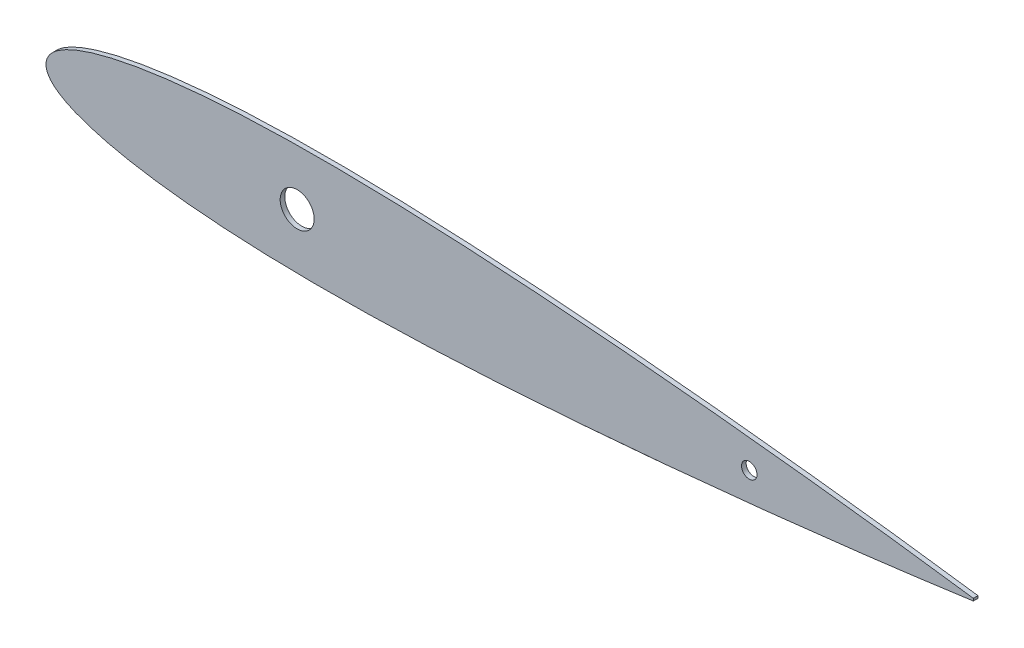
ISO-10303-21;
HEADER;
FILE_DESCRIPTION(('STEP AP214'),'2;1');
FILE_NAME('part.step','',(''),(''),'','','');
FILE_SCHEMA(('AUTOMOTIVE_DESIGN { 1 0 10303 214 1 1 1 1 }'));
ENDSEC;
DATA;
#1=APPLICATION_CONTEXT('core data for automotive mechanical design processes');
#2=APPLICATION_PROTOCOL_DEFINITION('international standard','automotive_design',2000,#1);
#3=PRODUCT_CONTEXT('',#1,'mechanical');
#4=PRODUCT('Part','Part','',(#3));
#5=PRODUCT_RELATED_PRODUCT_CATEGORY('part','',(#4));
#6=PRODUCT_DEFINITION_FORMATION('','',#4);
#7=PRODUCT_DEFINITION_CONTEXT('part definition',#1,'design');
#8=PRODUCT_DEFINITION('design','',#6,#7);
#9=PRODUCT_DEFINITION_SHAPE('','',#8);
#10=(LENGTH_UNIT() NAMED_UNIT(*) SI_UNIT(.MILLI.,.METRE.));
#11=(NAMED_UNIT(*) PLANE_ANGLE_UNIT() SI_UNIT($,.RADIAN.));
#12=(NAMED_UNIT(*) SI_UNIT($,.STERADIAN.) SOLID_ANGLE_UNIT());
#13=UNCERTAINTY_MEASURE_WITH_UNIT(LENGTH_MEASURE(1.E-05),#10,'distance_accuracy_value','');
#14=(GEOMETRIC_REPRESENTATION_CONTEXT(3) GLOBAL_UNCERTAINTY_ASSIGNED_CONTEXT((#13)) GLOBAL_UNIT_ASSIGNED_CONTEXT((#10,
#11,#12)) REPRESENTATION_CONTEXT('',''));
#15=CARTESIAN_POINT('',(0.,0.,0.));
#16=DIRECTION('',(0.,0.,1.));
#17=DIRECTION('',(1.,0.,0.));
#18=AXIS2_PLACEMENT_3D('',#15,#16,#17);
#19=CARTESIAN_POINT('',(300.,0.378000085790989,1.5));
#20=CARTESIAN_POINT('',(299.270406258191,0.47944593050947,1.5));
#21=CARTESIAN_POINT('',(297.234666466675,0.762503926957386,1.5));
#22=CARTESIAN_POINT('',(293.659648722086,1.25767379104816,1.5));
#23=CARTESIAN_POINT('',(289.112409324718,1.87424286789368,1.5));
#24=CARTESIAN_POINT('',(284.080813047262,2.54451801768884,1.5));
#25=CARTESIAN_POINT('',(278.752039397675,3.23812305057695,1.5));
#26=CARTESIAN_POINT('',(273.265892957003,3.93494732849179,1.5));
#27=CARTESIAN_POINT('',(267.705948145067,4.62902099310258,1.5));
#28=CARTESIAN_POINT('',(262.11455442435,5.31307031240466,1.5));
#29=CARTESIAN_POINT('',(256.508339041981,5.98219316973427,1.5));
#30=CARTESIAN_POINT('',(250.891727852538,6.63799231512792,1.5));
#31=CARTESIAN_POINT('',(245.269544547784,7.28178088713761,1.5));
#32=CARTESIAN_POINT('',(239.647331655705,7.91223455869152,1.5));
#33=CARTESIAN_POINT('',(234.025115138361,8.52699398080148,1.5));
#34=CARTESIAN_POINT('',(228.399071657966,9.1262318344847,1.5));
#35=CARTESIAN_POINT('',(222.768240122571,9.71307980985098,1.5));
#36=CARTESIAN_POINT('',(217.135901992854,10.2874621437674,1.5));
#37=CARTESIAN_POINT('',(211.505390076213,10.8469435449548,1.5));
#38=CARTESIAN_POINT('',(205.877598448554,11.3916454113051,1.5));
#39=CARTESIAN_POINT('',(200.251489742703,11.9208873285711,1.5));
#40=CARTESIAN_POINT('',(194.626396629031,12.4346198992476,1.5));
#41=CARTESIAN_POINT('',(189.002771953878,12.9319147435062,1.5));
#42=CARTESIAN_POINT('',(183.38150447918,13.4131006245791,1.5));
#43=CARTESIAN_POINT('',(177.763197882755,13.8763798492961,1.5));
#44=CARTESIAN_POINT('',(172.14827252579,14.3212404427836,1.5));
#45=CARTESIAN_POINT('',(166.537499181283,14.7478242644361,1.5));
#46=CARTESIAN_POINT('',(160.931704641983,15.1542315822589,1.5));
#47=CARTESIAN_POINT('',(155.33167602762,15.5391043814315,1.5));
#48=CARTESIAN_POINT('',(149.737504253089,15.9026531716997,1.5));
#49=CARTESIAN_POINT('',(144.148652919446,16.241849803566,1.5));
#50=CARTESIAN_POINT('',(138.565642977727,16.5574243030179,1.5));
#51=CARTESIAN_POINT('',(132.990821911634,16.8474013776404,1.5));
#52=CARTESIAN_POINT('',(127.427400286612,17.1102155605441,1.5));
#53=CARTESIAN_POINT('',(121.87757922466,17.3438956525447,1.5));
#54=CARTESIAN_POINT('',(116.340716908339,17.545260793534,1.5));
#55=CARTESIAN_POINT('',(110.815433459798,17.7126831386234,1.5));
#56=CARTESIAN_POINT('',(105.301229224759,17.844501986589,1.5));
#57=CARTESIAN_POINT('',(99.8005246938465,17.9400958831727,1.5));
#58=CARTESIAN_POINT('',(94.3173891780334,17.9965945216749,1.5));
#59=CARTESIAN_POINT('',(88.8557161622829,18.0101285441361,1.5));
#60=CARTESIAN_POINT('',(83.4185988364478,17.9792379195056,1.5));
#61=CARTESIAN_POINT('',(78.0084304611897,17.899164774015,1.5));
#62=CARTESIAN_POINT('',(72.6284037782424,17.7670378182798,1.5));
#63=CARTESIAN_POINT('',(67.2826859463778,17.5794179221706,1.5));
#64=CARTESIAN_POINT('',(61.9773108914634,17.3315194209052,1.5));
#65=CARTESIAN_POINT('',(56.720635819959,17.0210365128789,1.5));
#66=CARTESIAN_POINT('',(51.525118947017,16.640961845402,1.5));
#67=CARTESIAN_POINT('',(46.4081450832694,16.1901922640123,1.5));
#68=CARTESIAN_POINT('',(41.3941173921596,15.6616726526714,1.5));
#69=CARTESIAN_POINT('',(36.5156113066675,15.0539671994517,1.5));
#70=CARTESIAN_POINT('',(31.8189485954638,14.3656268642819,1.5));
#71=CARTESIAN_POINT('',(27.3661029727954,13.6034787702631,1.5));
#72=CARTESIAN_POINT('',(23.2351551610893,12.7825863440271,1.5));
#73=CARTESIAN_POINT('',(19.5025788109589,11.9202534557745,1.5));
#74=CARTESIAN_POINT('',(16.2182070077725,11.0446003021048,1.5));
#75=CARTESIAN_POINT('',(13.3891209887172,10.17507856394,1.5));
#76=CARTESIAN_POINT('',(10.9848637611105,9.3335008330135,1.5));
#77=CARTESIAN_POINT('',(8.96149544609948,8.52206481504195,1.5));
#78=CARTESIAN_POINT('',(7.26722563700957,7.74697775939544,1.5));
#79=CARTESIAN_POINT('',(5.84598572737683,7.01062721234571,1.5));
#80=CARTESIAN_POINT('',(4.64764407483782,6.30063546243401,1.5));
#81=CARTESIAN_POINT('',(3.62816800978614,5.60651493999264,1.5));
#82=CARTESIAN_POINT('',(2.75184175672911,4.92663636939092,1.5));
#83=CARTESIAN_POINT('',(2.0061897507256,4.24991822327024,1.5));
#84=CARTESIAN_POINT('',(1.3905183875593,3.57026030201869,1.5));
#85=CARTESIAN_POINT('',(0.900932574603405,2.89094290818637,1.5));
#86=CARTESIAN_POINT('',(0.529207590380777,2.22021977713324,1.5));
#87=CARTESIAN_POINT('',(0.260411531407435,1.56645929130347,1.5));
#88=CARTESIAN_POINT('',(0.0856446086737119,0.931036139354004,1.5));
#89=CARTESIAN_POINT('',(-0.00357731260795448,0.30898108461408,1.5));
#90=CARTESIAN_POINT('',(-0.00357731260776856,-0.308981084614831,1.5));
#91=CARTESIAN_POINT('',(0.0856446086737131,-0.931036139354699,1.5));
#92=CARTESIAN_POINT('',(0.260411531407615,-1.56645929130414,1.5));
#93=CARTESIAN_POINT('',(0.529207590381365,-2.22021977713392,1.5));
#94=CARTESIAN_POINT('',(0.900932574603896,-2.89094290818698,1.5));
#95=CARTESIAN_POINT('',(1.39051838756001,-3.57026030201881,1.5));
#96=CARTESIAN_POINT('',(2.00618975072613,-4.24991822327227,1.5));
#97=CARTESIAN_POINT('',(2.7518417567314,-4.92663636938398,1.5));
#98=CARTESIAN_POINT('',(3.62816800978217,-5.60651494002356,1.5));
#99=CARTESIAN_POINT('',(4.64764407486176,-6.3006354622981,1.5));
#100=CARTESIAN_POINT('',(5.84598572727588,-7.01062721295838,1.5));
#101=CARTESIAN_POINT('',(7.26722563748644,-7.74697775654586,1.5));
#102=CARTESIAN_POINT('',(8.96149544385093,-8.52206482852457,1.5));
#103=CARTESIAN_POINT('',(10.9848637718126,-9.33350076889671,1.5));
#104=CARTESIAN_POINT('',(13.3891209381216,-10.1750788671249,1.5));
#105=CARTESIAN_POINT('',(16.2182072447027,-11.0445988824028,1.5));
#106=CARTESIAN_POINT('',(19.5025777214158,-11.9202599844474,1.5));
#107=CARTESIAN_POINT('',(23.2351600059408,-12.7825573131507,1.5));
#108=CARTESIAN_POINT('',(27.366065702866,-13.6035992472578,1.5));
#109=CARTESIAN_POINT('',(31.8190141628901,-14.365116622676,1.5));
#110=CARTESIAN_POINT('',(36.5155748574454,-15.0541095127907,1.5));
#111=CARTESIAN_POINT('',(41.3941235310745,-15.6616324404357,1.5));
#112=CARTESIAN_POINT('',(46.4081433882141,-16.1902033672854,1.5));
#113=CARTESIAN_POINT('',(51.5251194115053,-16.6409588028352,1.5));
#114=CARTESIAN_POINT('',(56.7206356933644,-17.0210373421311,1.5));
#115=CARTESIAN_POINT('',(61.9773109258477,-17.3315191956824,1.5));
#116=CARTESIAN_POINT('',(67.2826859370659,-17.5794179831741,1.5));
#117=CARTESIAN_POINT('',(72.628403780765,-17.7670378017619,1.5));
#118=CARTESIAN_POINT('',(78.0084304605121,-17.8991647784591,1.5));
#119=CARTESIAN_POINT('',(83.4185988366349,-17.9792379182859,1.5));
#120=CARTESIAN_POINT('',(88.8557161622367,-18.0101285444441,1.5));
#121=CARTESIAN_POINT('',(94.3173891780499,-17.9965945215692,1.5));
#122=CARTESIAN_POINT('',(99.8005246938458,-17.9400958831771,1.5));
#123=CARTESIAN_POINT('',(105.301229224763,-17.8445019865625,1.5));
#124=CARTESIAN_POINT('',(110.8154334598,-17.7126831386037,1.5));
#125=CARTESIAN_POINT('',(116.340716908343,-17.5452607935111,1.5));
#126=CARTESIAN_POINT('',(121.877579224663,-17.3438956525212,1.5));
#127=CARTESIAN_POINT('',(127.427400286615,-17.1102155605194,1.5));
#128=CARTESIAN_POINT('',(132.990821911637,-16.8474013776146,1.5));
#129=CARTESIAN_POINT('',(138.565642977729,-16.557424302991,1.5));
#130=CARTESIAN_POINT('',(144.148652919448,-16.241849803538,1.5));
#131=CARTESIAN_POINT('',(149.737504253092,-15.9026531716705,1.5));
#132=CARTESIAN_POINT('',(155.331676027623,-15.5391043814012,1.5));
#133=CARTESIAN_POINT('',(160.931704641986,-15.1542315822275,1.5));
#134=CARTESIAN_POINT('',(166.537499181286,-14.7478242644037,1.5));
#135=CARTESIAN_POINT('',(172.148272525793,-14.32124044275,1.5));
#136=CARTESIAN_POINT('',(177.763197882757,-13.8763798492613,1.5));
#137=CARTESIAN_POINT('',(183.381504479182,-13.4131006245432,1.5));
#138=CARTESIAN_POINT('',(189.002771953881,-12.9319147434693,1.5));
#139=CARTESIAN_POINT('',(194.626396629033,-12.4346198992095,1.5));
#140=CARTESIAN_POINT('',(200.251489742704,-11.9208873285319,1.5));
#141=CARTESIAN_POINT('',(205.877598448556,-11.3916454112647,1.5));
#142=CARTESIAN_POINT('',(211.505390076214,-10.8469435449134,1.5));
#143=CARTESIAN_POINT('',(217.135901992857,-10.2874621437248,1.5));
#144=CARTESIAN_POINT('',(222.768240122573,-9.71307980980728,1.5));
#145=CARTESIAN_POINT('',(228.399071657967,-9.12623183443991,1.5));
#146=CARTESIAN_POINT('',(234.025115138362,-8.52699398075554,1.5));
#147=CARTESIAN_POINT('',(239.647331655707,-7.91223455864449,1.5));
#148=CARTESIAN_POINT('',(245.269544547784,-7.28178088708938,1.5));
#149=CARTESIAN_POINT('',(250.891727852538,-6.63799231507864,1.5));
#150=CARTESIAN_POINT('',(256.508339041982,-5.98219316968383,1.5));
#151=CARTESIAN_POINT('',(262.114554424352,-5.31307031235314,1.5));
#152=CARTESIAN_POINT('',(267.705948145068,-4.6290209930499,1.5));
#153=CARTESIAN_POINT('',(273.265892957004,-3.934947328438,1.5));
#154=CARTESIAN_POINT('',(278.752039397677,-3.23812305052208,1.5));
#155=CARTESIAN_POINT('',(284.080813047262,-2.54451801763288,1.5));
#156=CARTESIAN_POINT('',(289.112409324719,-1.87424286783675,1.5));
#157=CARTESIAN_POINT('',(293.659648722086,-1.25767379099031,1.5));
#158=CARTESIAN_POINT('',(297.234666466675,-0.762503926898819,1.5));
#159=CARTESIAN_POINT('',(299.270406258191,-0.479445930450507,1.5));
#160=CARTESIAN_POINT('',(300.,-0.378000085731868,1.5));
#161=B_SPLINE_CURVE_WITH_KNOTS('',3,(#19,#20,#21,#22,#23,#24,#25,#26,#27,#28,#29,#30,#31,#32,
#33,#34,#35,#36,#37,#38,#39,#40,#41,#42,#43,#44,#45,#46,#47,#48,#49,#50,#51,#52,#53,#54,#55,#56,
#57,#58,#59,#60,#61,#62,#63,#64,#65,#66,#67,#68,#69,#70,#71,#72,#73,#74,#75,#76,#77,#78,#79,#80,
#81,#82,#83,#84,#85,#86,#87,#88,#89,#90,#91,#92,#93,#94,#95,#96,#97,#98,#99,#100,#101,#102,#103,
#104,#105,#106,#107,#108,#109,#110,#111,#112,#113,#114,#115,#116,#117,#118,#119,#120,#121,#122,
#123,#124,#125,#126,#127,#128,#129,#130,#131,#132,#133,#134,#135,#136,#137,#138,#139,#140,#141,
#142,#143,#144,#145,#146,#147,#148,#149,#150,#151,#152,#153,#154,#155,#156,#157,#158,#159,#160),
.UNSPECIFIED.,.F.,.F.,(4,1,1,1,1,1,1,1,1,1,1,1,1,1,1,1,1,1,1,1,1,1,1,1,1,1,1,1,1,1,1,1,1,1,1,1,
1,1,1,1,1,1,1,1,1,1,1,1,1,1,1,1,1,1,1,1,1,1,1,1,1,1,1,1,1,1,1,1,1,1,1,1,1,1,1,1,1,1,1,1,1,1,1,1,
1,1,1,1,1,1,1,1,1,1,1,1,1,1,1,1,1,1,1,1,1,1,1,1,1,1,1,1,1,1,1,1,1,1,1,1,1,1,1,1,1,1,1,1,1,1,1,1,
1,1,1,1,1,1,1,4),(0.,0.00361222059404388,0.0100789532278554,0.0176986181570895,
0.0261151107220122,0.0349709660638799,0.0440503796486832,0.0532343297369713,0.0624475697827881,
0.0716739929600303,0.0809213185094618,0.0901775382979332,0.0994243421366575,0.108664440992277,
0.117912199004999,0.127169502180609,0.136426594565023,0.145675425736823,0.154916495397513,
0.164153236916375,0.173386648526191,0.182615736180586,0.191838089492061,0.201053134496137,
0.210260392550908,0.219458942389608,0.228646746886173,0.237822316287067,0.24698522413025,
0.25613738364592,0.265279415916296,0.274406949966901,0.283512193452554,0.292591781113348,
0.30164628535433,0.310681792653752,0.31969906757785,0.32869451957993,0.337660159695399,
0.346588583205171,0.355477411634764,0.364322937295264,0.373121613643215,0.381867635356829,
0.390553004884712,0.399166025869356,0.407689628257838,0.416098119030288,0.424354887451602,
0.432412428746428,0.440204728485537,0.447630505181733,0.454563637698397,0.460855379429517,
0.466413319364109,0.471228610451128,0.475365774282038,0.478901259753558,0.481915077255184,
0.484498871900912,0.486747127386087,0.488741251833575,0.490543179252672,0.492182103901344,
0.493672830547239,0.495031907807012,0.496279059618418,0.497424736506128,0.498490165528455,
0.499502757789975,0.500497253863142,0.501509846124661,0.502575275146988,0.503720952034698,
0.504968103846104,0.506327181105877,0.507817907751772,0.509456832400444,0.511258759819541,
0.51325288426703,0.515501139752205,0.518084934397933,0.521098751899559,0.524634237371078,
0.528771401201989,0.533586692289008,0.539144632223599,0.545436373954719,0.552369506471383,
0.559795200118754,0.567587571253572,0.575645112548398,0.583901880969712,0.592310371742162,
0.600833974130644,0.609446995115288,0.618132364643171,0.626878386356785,0.635677062704736,
0.644522588365236,0.653411416794829,0.662339840304601,0.67130548042007,0.68030093242215,
0.689318207346248,0.69835371464567,0.707408218886652,0.716487806547446,0.725593050033099,
0.734720584083704,0.74386261635408,0.75301477586975,0.762177683712933,0.771353253113827,
0.780541057610392,0.789739607449093,0.798946865503863,0.808161910507939,0.817384263819414,
0.826613351473809,0.835846763083625,0.845083504602487,0.854324574263177,0.863573405434977,
0.872830497819391,0.882087800995001,0.891335559007723,0.900575657863343,0.909822461702067,
0.919078681490538,0.92832600703997,0.937552430217212,0.946765670263029,0.955949620351317,
0.96502903393612,0.973884889277988,0.982301381842911,0.989921046772145,0.996387779405956,1.),.UNSPECIFIED.);
#162=DIRECTION('',(0.,0.,-1.));
#163=VECTOR('',#162,1.);
#164=SURFACE_OF_LINEAR_EXTRUSION('',#161,#163);
#165=CARTESIAN_POINT('',(300.,0.378000085790989,0.));
#166=CARTESIAN_POINT('',(299.270406258191,0.47944593050947,0.));
#167=CARTESIAN_POINT('',(297.234666466675,0.762503926957386,0.));
#168=CARTESIAN_POINT('',(293.659648722086,1.25767379104816,0.));
#169=CARTESIAN_POINT('',(289.112409324718,1.87424286789368,0.));
#170=CARTESIAN_POINT('',(284.080813047262,2.54451801768884,0.));
#171=CARTESIAN_POINT('',(278.752039397675,3.23812305057695,0.));
#172=CARTESIAN_POINT('',(273.265892957003,3.93494732849179,0.));
#173=CARTESIAN_POINT('',(267.705948145067,4.62902099310258,0.));
#174=CARTESIAN_POINT('',(262.11455442435,5.31307031240466,0.));
#175=CARTESIAN_POINT('',(256.508339041981,5.98219316973427,0.));
#176=CARTESIAN_POINT('',(250.891727852538,6.63799231512792,0.));
#177=CARTESIAN_POINT('',(245.269544547784,7.28178088713761,0.));
#178=CARTESIAN_POINT('',(239.647331655705,7.91223455869152,0.));
#179=CARTESIAN_POINT('',(234.025115138361,8.52699398080148,0.));
#180=CARTESIAN_POINT('',(228.399071657966,9.1262318344847,0.));
#181=CARTESIAN_POINT('',(222.768240122571,9.71307980985098,0.));
#182=CARTESIAN_POINT('',(217.135901992854,10.2874621437674,0.));
#183=CARTESIAN_POINT('',(211.505390076213,10.8469435449548,0.));
#184=CARTESIAN_POINT('',(205.877598448554,11.3916454113051,0.));
#185=CARTESIAN_POINT('',(200.251489742703,11.9208873285711,0.));
#186=CARTESIAN_POINT('',(194.626396629031,12.4346198992476,0.));
#187=CARTESIAN_POINT('',(189.002771953878,12.9319147435062,0.));
#188=CARTESIAN_POINT('',(183.38150447918,13.4131006245791,0.));
#189=CARTESIAN_POINT('',(177.763197882755,13.8763798492961,0.));
#190=CARTESIAN_POINT('',(172.14827252579,14.3212404427836,0.));
#191=CARTESIAN_POINT('',(166.537499181283,14.7478242644361,0.));
#192=CARTESIAN_POINT('',(160.931704641983,15.1542315822589,0.));
#193=CARTESIAN_POINT('',(155.33167602762,15.5391043814315,0.));
#194=CARTESIAN_POINT('',(149.737504253089,15.9026531716997,0.));
#195=CARTESIAN_POINT('',(144.148652919446,16.241849803566,0.));
#196=CARTESIAN_POINT('',(138.565642977727,16.5574243030179,0.));
#197=CARTESIAN_POINT('',(132.990821911634,16.8474013776404,0.));
#198=CARTESIAN_POINT('',(127.427400286612,17.1102155605441,0.));
#199=CARTESIAN_POINT('',(121.87757922466,17.3438956525447,0.));
#200=CARTESIAN_POINT('',(116.340716908339,17.545260793534,0.));
#201=CARTESIAN_POINT('',(110.815433459798,17.7126831386234,0.));
#202=CARTESIAN_POINT('',(105.301229224759,17.844501986589,0.));
#203=CARTESIAN_POINT('',(99.8005246938465,17.9400958831727,0.));
#204=CARTESIAN_POINT('',(94.3173891780334,17.9965945216749,0.));
#205=CARTESIAN_POINT('',(88.8557161622829,18.0101285441361,0.));
#206=CARTESIAN_POINT('',(83.4185988364478,17.9792379195056,0.));
#207=CARTESIAN_POINT('',(78.0084304611897,17.899164774015,0.));
#208=CARTESIAN_POINT('',(72.6284037782424,17.7670378182798,0.));
#209=CARTESIAN_POINT('',(67.2826859463778,17.5794179221706,0.));
#210=CARTESIAN_POINT('',(61.9773108914634,17.3315194209052,0.));
#211=CARTESIAN_POINT('',(56.720635819959,17.0210365128789,0.));
#212=CARTESIAN_POINT('',(51.525118947017,16.640961845402,0.));
#213=CARTESIAN_POINT('',(46.4081450832694,16.1901922640123,0.));
#214=CARTESIAN_POINT('',(41.3941173921596,15.6616726526714,0.));
#215=CARTESIAN_POINT('',(36.5156113066675,15.0539671994517,0.));
#216=CARTESIAN_POINT('',(31.8189485954638,14.3656268642819,0.));
#217=CARTESIAN_POINT('',(27.3661029727954,13.6034787702631,0.));
#218=CARTESIAN_POINT('',(23.2351551610893,12.7825863440271,0.));
#219=CARTESIAN_POINT('',(19.5025788109589,11.9202534557745,0.));
#220=CARTESIAN_POINT('',(16.2182070077725,11.0446003021048,0.));
#221=CARTESIAN_POINT('',(13.3891209887172,10.17507856394,0.));
#222=CARTESIAN_POINT('',(10.9848637611105,9.3335008330135,0.));
#223=CARTESIAN_POINT('',(8.96149544609948,8.52206481504195,0.));
#224=CARTESIAN_POINT('',(7.26722563700957,7.74697775939544,0.));
#225=CARTESIAN_POINT('',(5.84598572737683,7.01062721234571,0.));
#226=CARTESIAN_POINT('',(4.64764407483782,6.30063546243401,0.));
#227=CARTESIAN_POINT('',(3.62816800978614,5.60651493999264,0.));
#228=CARTESIAN_POINT('',(2.75184175672911,4.92663636939092,0.));
#229=CARTESIAN_POINT('',(2.0061897507256,4.24991822327024,0.));
#230=CARTESIAN_POINT('',(1.3905183875593,3.57026030201869,0.));
#231=CARTESIAN_POINT('',(0.900932574603405,2.89094290818637,0.));
#232=CARTESIAN_POINT('',(0.529207590380777,2.22021977713324,0.));
#233=CARTESIAN_POINT('',(0.260411531407435,1.56645929130347,0.));
#234=CARTESIAN_POINT('',(0.0856446086737119,0.931036139354004,0.));
#235=CARTESIAN_POINT('',(-0.00357731260795448,0.30898108461408,0.));
#236=CARTESIAN_POINT('',(-0.00357731260776856,-0.308981084614831,0.));
#237=CARTESIAN_POINT('',(0.0856446086737131,-0.931036139354699,0.));
#238=CARTESIAN_POINT('',(0.260411531407615,-1.56645929130414,0.));
#239=CARTESIAN_POINT('',(0.529207590381365,-2.22021977713392,0.));
#240=CARTESIAN_POINT('',(0.900932574603896,-2.89094290818698,0.));
#241=CARTESIAN_POINT('',(1.39051838756001,-3.57026030201881,0.));
#242=CARTESIAN_POINT('',(2.00618975072613,-4.24991822327227,0.));
#243=CARTESIAN_POINT('',(2.7518417567314,-4.92663636938398,0.));
#244=CARTESIAN_POINT('',(3.62816800978217,-5.60651494002356,0.));
#245=CARTESIAN_POINT('',(4.64764407486176,-6.3006354622981,0.));
#246=CARTESIAN_POINT('',(5.84598572727588,-7.01062721295838,0.));
#247=CARTESIAN_POINT('',(7.26722563748644,-7.74697775654586,0.));
#248=CARTESIAN_POINT('',(8.96149544385093,-8.52206482852457,0.));
#249=CARTESIAN_POINT('',(10.9848637718126,-9.33350076889671,0.));
#250=CARTESIAN_POINT('',(13.3891209381216,-10.1750788671249,0.));
#251=CARTESIAN_POINT('',(16.2182072447027,-11.0445988824028,0.));
#252=CARTESIAN_POINT('',(19.5025777214158,-11.9202599844474,0.));
#253=CARTESIAN_POINT('',(23.2351600059408,-12.7825573131507,0.));
#254=CARTESIAN_POINT('',(27.366065702866,-13.6035992472578,0.));
#255=CARTESIAN_POINT('',(31.8190141628901,-14.365116622676,0.));
#256=CARTESIAN_POINT('',(36.5155748574454,-15.0541095127907,0.));
#257=CARTESIAN_POINT('',(41.3941235310745,-15.6616324404357,0.));
#258=CARTESIAN_POINT('',(46.4081433882141,-16.1902033672854,0.));
#259=CARTESIAN_POINT('',(51.5251194115053,-16.6409588028352,0.));
#260=CARTESIAN_POINT('',(56.7206356933644,-17.0210373421311,0.));
#261=CARTESIAN_POINT('',(61.9773109258477,-17.3315191956824,0.));
#262=CARTESIAN_POINT('',(67.2826859370659,-17.5794179831741,0.));
#263=CARTESIAN_POINT('',(72.628403780765,-17.7670378017619,0.));
#264=CARTESIAN_POINT('',(78.0084304605121,-17.8991647784591,0.));
#265=CARTESIAN_POINT('',(83.4185988366349,-17.9792379182859,0.));
#266=CARTESIAN_POINT('',(88.8557161622367,-18.0101285444441,0.));
#267=CARTESIAN_POINT('',(94.3173891780499,-17.9965945215692,0.));
#268=CARTESIAN_POINT('',(99.8005246938458,-17.9400958831771,0.));
#269=CARTESIAN_POINT('',(105.301229224763,-17.8445019865625,0.));
#270=CARTESIAN_POINT('',(110.8154334598,-17.7126831386037,0.));
#271=CARTESIAN_POINT('',(116.340716908343,-17.5452607935111,0.));
#272=CARTESIAN_POINT('',(121.877579224663,-17.3438956525212,0.));
#273=CARTESIAN_POINT('',(127.427400286615,-17.1102155605194,0.));
#274=CARTESIAN_POINT('',(132.990821911637,-16.8474013776146,0.));
#275=CARTESIAN_POINT('',(138.565642977729,-16.557424302991,0.));
#276=CARTESIAN_POINT('',(144.148652919448,-16.241849803538,0.));
#277=CARTESIAN_POINT('',(149.737504253092,-15.9026531716705,0.));
#278=CARTESIAN_POINT('',(155.331676027623,-15.5391043814012,0.));
#279=CARTESIAN_POINT('',(160.931704641986,-15.1542315822275,0.));
#280=CARTESIAN_POINT('',(166.537499181286,-14.7478242644037,0.));
#281=CARTESIAN_POINT('',(172.148272525793,-14.32124044275,0.));
#282=CARTESIAN_POINT('',(177.763197882757,-13.8763798492613,0.));
#283=CARTESIAN_POINT('',(183.381504479182,-13.4131006245432,0.));
#284=CARTESIAN_POINT('',(189.002771953881,-12.9319147434693,0.));
#285=CARTESIAN_POINT('',(194.626396629033,-12.4346198992095,0.));
#286=CARTESIAN_POINT('',(200.251489742704,-11.9208873285319,0.));
#287=CARTESIAN_POINT('',(205.877598448556,-11.3916454112647,0.));
#288=CARTESIAN_POINT('',(211.505390076214,-10.8469435449134,0.));
#289=CARTESIAN_POINT('',(217.135901992857,-10.2874621437248,0.));
#290=CARTESIAN_POINT('',(222.768240122573,-9.71307980980728,0.));
#291=CARTESIAN_POINT('',(228.399071657967,-9.12623183443991,0.));
#292=CARTESIAN_POINT('',(234.025115138362,-8.52699398075554,0.));
#293=CARTESIAN_POINT('',(239.647331655707,-7.91223455864449,0.));
#294=CARTESIAN_POINT('',(245.269544547784,-7.28178088708938,0.));
#295=CARTESIAN_POINT('',(250.891727852538,-6.63799231507864,0.));
#296=CARTESIAN_POINT('',(256.508339041982,-5.98219316968383,0.));
#297=CARTESIAN_POINT('',(262.114554424352,-5.31307031235314,0.));
#298=CARTESIAN_POINT('',(267.705948145068,-4.6290209930499,0.));
#299=CARTESIAN_POINT('',(273.265892957004,-3.934947328438,0.));
#300=CARTESIAN_POINT('',(278.752039397677,-3.23812305052208,0.));
#301=CARTESIAN_POINT('',(284.080813047262,-2.54451801763288,0.));
#302=CARTESIAN_POINT('',(289.112409324719,-1.87424286783675,0.));
#303=CARTESIAN_POINT('',(293.659648722086,-1.25767379099031,0.));
#304=CARTESIAN_POINT('',(297.234666466675,-0.762503926898819,0.));
#305=CARTESIAN_POINT('',(299.270406258191,-0.479445930450507,0.));
#306=CARTESIAN_POINT('',(300.,-0.378000085731868,0.));
#307=B_SPLINE_CURVE_WITH_KNOTS('',3,(#165,#166,#167,#168,#169,#170,#171,#172,#173,#174,#175,
#176,#177,#178,#179,#180,#181,#182,#183,#184,#185,#186,#187,#188,#189,#190,#191,#192,#193,#194,
#195,#196,#197,#198,#199,#200,#201,#202,#203,#204,#205,#206,#207,#208,#209,#210,#211,#212,#213,
#214,#215,#216,#217,#218,#219,#220,#221,#222,#223,#224,#225,#226,#227,#228,#229,#230,#231,#232,
#233,#234,#235,#236,#237,#238,#239,#240,#241,#242,#243,#244,#245,#246,#247,#248,#249,#250,#251,
#252,#253,#254,#255,#256,#257,#258,#259,#260,#261,#262,#263,#264,#265,#266,#267,#268,#269,#270,
#271,#272,#273,#274,#275,#276,#277,#278,#279,#280,#281,#282,#283,#284,#285,#286,#287,#288,#289,
#290,#291,#292,#293,#294,#295,#296,#297,#298,#299,#300,#301,#302,#303,#304,#305,#306),
.UNSPECIFIED.,.F.,.F.,(4,1,1,1,1,1,1,1,1,1,1,1,1,1,1,1,1,1,1,1,1,1,1,1,1,1,1,1,1,1,1,1,1,1,1,1,
1,1,1,1,1,1,1,1,1,1,1,1,1,1,1,1,1,1,1,1,1,1,1,1,1,1,1,1,1,1,1,1,1,1,1,1,1,1,1,1,1,1,1,1,1,1,1,1,
1,1,1,1,1,1,1,1,1,1,1,1,1,1,1,1,1,1,1,1,1,1,1,1,1,1,1,1,1,1,1,1,1,1,1,1,1,1,1,1,1,1,1,1,1,1,1,1,
1,1,1,1,1,1,1,4),(0.,0.00361222059404388,0.0100789532278554,0.0176986181570895,
0.0261151107220122,0.0349709660638799,0.0440503796486832,0.0532343297369713,0.0624475697827881,
0.0716739929600303,0.0809213185094618,0.0901775382979332,0.0994243421366575,0.108664440992277,
0.117912199004999,0.127169502180609,0.136426594565023,0.145675425736823,0.154916495397513,
0.164153236916375,0.173386648526191,0.182615736180586,0.191838089492061,0.201053134496137,
0.210260392550908,0.219458942389608,0.228646746886173,0.237822316287067,0.24698522413025,
0.25613738364592,0.265279415916296,0.274406949966901,0.283512193452554,0.292591781113348,
0.30164628535433,0.310681792653752,0.31969906757785,0.32869451957993,0.337660159695399,
0.346588583205171,0.355477411634764,0.364322937295264,0.373121613643215,0.381867635356829,
0.390553004884712,0.399166025869356,0.407689628257838,0.416098119030288,0.424354887451602,
0.432412428746428,0.440204728485537,0.447630505181733,0.454563637698397,0.460855379429517,
0.466413319364109,0.471228610451128,0.475365774282038,0.478901259753558,0.481915077255184,
0.484498871900912,0.486747127386087,0.488741251833575,0.490543179252672,0.492182103901344,
0.493672830547239,0.495031907807012,0.496279059618418,0.497424736506128,0.498490165528455,
0.499502757789975,0.500497253863142,0.501509846124661,0.502575275146988,0.503720952034698,
0.504968103846104,0.506327181105877,0.507817907751772,0.509456832400444,0.511258759819541,
0.51325288426703,0.515501139752205,0.518084934397933,0.521098751899559,0.524634237371078,
0.528771401201989,0.533586692289008,0.539144632223599,0.545436373954719,0.552369506471383,
0.559795200118754,0.567587571253572,0.575645112548398,0.583901880969712,0.592310371742162,
0.600833974130644,0.609446995115288,0.618132364643171,0.626878386356785,0.635677062704736,
0.644522588365236,0.653411416794829,0.662339840304601,0.67130548042007,0.68030093242215,
0.689318207346248,0.69835371464567,0.707408218886652,0.716487806547446,0.725593050033099,
0.734720584083704,0.74386261635408,0.75301477586975,0.762177683712933,0.771353253113827,
0.780541057610392,0.789739607449093,0.798946865503863,0.808161910507939,0.817384263819414,
0.826613351473809,0.835846763083625,0.845083504602487,0.854324574263177,0.863573405434977,
0.872830497819391,0.882087800995001,0.891335559007723,0.900575657863343,0.909822461702067,
0.919078681490538,0.92832600703997,0.937552430217212,0.946765670263029,0.955949620351317,
0.96502903393612,0.973884889277988,0.982301381842911,0.989921046772145,0.996387779405956,1.),.UNSPECIFIED.);
#308=CARTESIAN_POINT('',(300.,0.378000085790989,0.));
#309=VERTEX_POINT('',#308);
#310=CARTESIAN_POINT('',(300.,-0.378000085731868,0.));
#311=VERTEX_POINT('',#310);
#312=EDGE_CURVE('E69',#309,#311,#307,.T.);
#313=ORIENTED_EDGE('',*,*,#312,.T.);
#314=DIRECTION('',(0.,0.,-1.));
#315=VECTOR('',#314,1.);
#316=CARTESIAN_POINT('',(300.,-0.378000085731868,1.5));
#317=LINE('',#316,#315);
#318=CARTESIAN_POINT('',(300.,-0.378000085731868,1.5));
#319=VERTEX_POINT('',#318);
#320=EDGE_CURVE('E11',#319,#311,#317,.T.);
#321=ORIENTED_EDGE('',*,*,#320,.F.);
#322=CARTESIAN_POINT('',(300.,0.378000085790989,1.5));
#323=VERTEX_POINT('',#322);
#324=EDGE_CURVE('E68',#323,#319,#161,.T.);
#325=ORIENTED_EDGE('',*,*,#324,.F.);
#326=DIRECTION('',(0.,0.,-1.));
#327=VECTOR('',#326,1.);
#328=CARTESIAN_POINT('',(300.,0.378000085790989,1.5));
#329=LINE('',#328,#327);
#330=EDGE_CURVE('E46',#323,#309,#329,.T.);
#331=ORIENTED_EDGE('',*,*,#330,.T.);
#332=EDGE_LOOP('',(#313,#321,#325,#331));
#333=FACE_BOUND('',#332,.T.);
#334=ADVANCED_FACE('F37',(#333),#164,.F.);
#335=CARTESIAN_POINT('',(300.,0.378000085790989,1.5));
#336=DIRECTION('',(-1.,0.,0.));
#337=DIRECTION('',(0.,0.,1.));
#338=AXIS2_PLACEMENT_3D('',#335,#336,#337);
#339=PLANE('',#338);
#340=DIRECTION('',(0.,1.,0.));
#341=VECTOR('',#340,1.);
#342=CARTESIAN_POINT('',(300.,0.378000085790989,0.));
#343=LINE('',#342,#341);
#344=EDGE_CURVE('E61',#311,#309,#343,.T.);
#345=ORIENTED_EDGE('',*,*,#344,.T.);
#346=ORIENTED_EDGE('',*,*,#330,.F.);
#347=DIRECTION('',(0.,1.,0.));
#348=VECTOR('',#347,1.);
#349=CARTESIAN_POINT('',(300.,0.378000085790989,1.5));
#350=LINE('',#349,#348);
#351=EDGE_CURVE('E53',#319,#323,#350,.T.);
#352=ORIENTED_EDGE('',*,*,#351,.F.);
#353=ORIENTED_EDGE('',*,*,#320,.T.);
#354=EDGE_LOOP('',(#345,#346,#352,#353));
#355=FACE_BOUND('',#354,.T.);
#356=ADVANCED_FACE('F64',(#355),#339,.F.);
#357=CARTESIAN_POINT('',(1.47356104603987E-12,3.56765423450365E-06,1.5));
#358=DIRECTION('',(0.,0.,-1.));
#359=DIRECTION('',(-1.,0.,0.));
#360=AXIS2_PLACEMENT_3D('',#357,#358,#359);
#361=PLANE('',#360);
#362=CARTESIAN_POINT('',(81.25,0.,1.5));
#363=DIRECTION('',(0.,0.,1.));
#364=DIRECTION('',(1.,0.,0.));
#365=AXIS2_PLACEMENT_3D('',#362,#363,#364);
#366=CIRCLE('',#365,5.5);
#367=CARTESIAN_POINT('',(86.75,0.,1.5));
#368=VERTEX_POINT('',#367);
#369=EDGE_CURVE('E76',#368,#368,#366,.T.);
#370=ORIENTED_EDGE('',*,*,#369,.F.);
#371=EDGE_LOOP('',(#370));
#372=FACE_BOUND('',#371,.T.);
#373=CARTESIAN_POINT('',(227.5,0.,1.5));
#374=DIRECTION('',(0.,0.,1.));
#375=DIRECTION('',(1.,0.,0.));
#376=AXIS2_PLACEMENT_3D('',#373,#374,#375);
#377=CIRCLE('',#376,2.50000000000002);
#378=CARTESIAN_POINT('',(230.,0.,1.5));
#379=VERTEX_POINT('',#378);
#380=EDGE_CURVE('E88',#379,#379,#377,.T.);
#381=ORIENTED_EDGE('',*,*,#380,.F.);
#382=EDGE_LOOP('',(#381));
#383=FACE_BOUND('',#382,.T.);
#384=ORIENTED_EDGE('',*,*,#324,.T.);
#385=ORIENTED_EDGE('',*,*,#351,.T.);
#386=EDGE_LOOP('',(#384,#385));
#387=FACE_BOUND('',#386,.T.);
#388=ADVANCED_FACE('F102',(#372,#383,#387),#361,.F.);
#389=CARTESIAN_POINT('',(1.47356104603987E-12,3.56765423450365E-06,0.));
#390=DIRECTION('',(0.,0.,-1.));
#391=DIRECTION('',(-1.,0.,0.));
#392=AXIS2_PLACEMENT_3D('',#389,#390,#391);
#393=PLANE('',#392);
#394=CARTESIAN_POINT('',(81.25,0.,0.));
#395=DIRECTION('',(0.,0.,1.));
#396=DIRECTION('',(1.,0.,0.));
#397=AXIS2_PLACEMENT_3D('',#394,#395,#396);
#398=CIRCLE('',#397,5.5);
#399=CARTESIAN_POINT('',(86.75,0.,0.));
#400=VERTEX_POINT('',#399);
#401=EDGE_CURVE('E73',#400,#400,#398,.T.);
#402=ORIENTED_EDGE('',*,*,#401,.T.);
#403=EDGE_LOOP('',(#402));
#404=FACE_BOUND('',#403,.T.);
#405=CARTESIAN_POINT('',(227.5,0.,0.));
#406=DIRECTION('',(0.,0.,1.));
#407=DIRECTION('',(1.,0.,0.));
#408=AXIS2_PLACEMENT_3D('',#405,#406,#407);
#409=CIRCLE('',#408,2.50000000000002);
#410=CARTESIAN_POINT('',(230.,0.,0.));
#411=VERTEX_POINT('',#410);
#412=EDGE_CURVE('E94',#411,#411,#409,.T.);
#413=ORIENTED_EDGE('',*,*,#412,.T.);
#414=EDGE_LOOP('',(#413));
#415=FACE_BOUND('',#414,.T.);
#416=ORIENTED_EDGE('',*,*,#312,.F.);
#417=ORIENTED_EDGE('',*,*,#344,.F.);
#418=EDGE_LOOP('',(#416,#417));
#419=FACE_BOUND('',#418,.T.);
#420=ADVANCED_FACE('F72',(#404,#415,#419),#393,.T.);
#421=CARTESIAN_POINT('',(227.5,0.,0.));
#422=DIRECTION('',(0.,0.,1.));
#423=DIRECTION('',(1.,0.,0.));
#424=AXIS2_PLACEMENT_3D('',#421,#422,#423);
#425=CYLINDRICAL_SURFACE('',#424,2.50000000000002);
#426=ORIENTED_EDGE('',*,*,#412,.F.);
#427=EDGE_LOOP('',(#426));
#428=FACE_BOUND('',#427,.T.);
#429=ORIENTED_EDGE('',*,*,#380,.T.);
#430=EDGE_LOOP('',(#429));
#431=FACE_BOUND('',#430,.T.);
#432=ADVANCED_FACE('F108',(#428,#431),#425,.F.);
#433=CARTESIAN_POINT('',(81.25,0.,0.));
#434=DIRECTION('',(0.,0.,1.));
#435=DIRECTION('',(1.,0.,0.));
#436=AXIS2_PLACEMENT_3D('',#433,#434,#435);
#437=CYLINDRICAL_SURFACE('',#436,5.5);
#438=ORIENTED_EDGE('',*,*,#401,.F.);
#439=EDGE_LOOP('',(#438));
#440=FACE_BOUND('',#439,.T.);
#441=ORIENTED_EDGE('',*,*,#369,.T.);
#442=EDGE_LOOP('',(#441));
#443=FACE_BOUND('',#442,.T.);
#444=ADVANCED_FACE('F100',(#440,#443),#437,.F.);
#445=CLOSED_SHELL('',(#334,#356,#388,#420,#432,#444));
#446=MANIFOLD_SOLID_BREP('B2',#445);
#447=ADVANCED_BREP_SHAPE_REPRESENTATION('',(#18,#446),#14);
#448=SHAPE_DEFINITION_REPRESENTATION(#9,#447);
ENDSEC;
END-ISO-10303-21;
